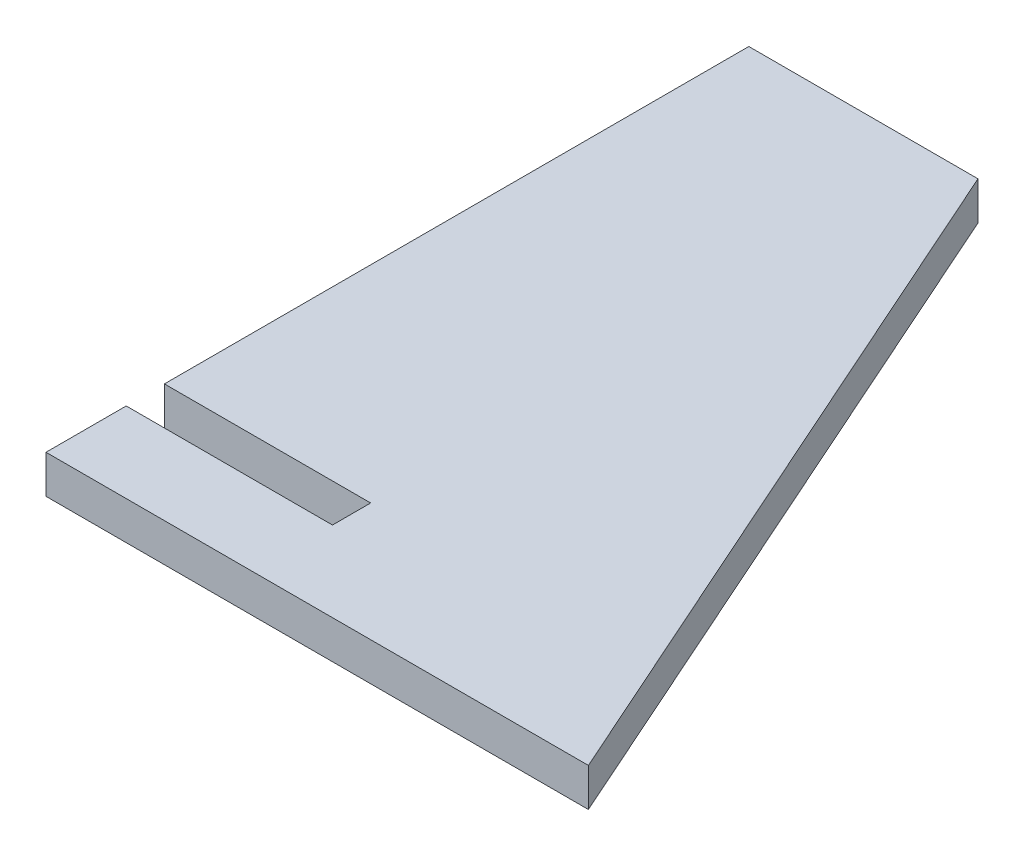
ISO-10303-21;
HEADER;
FILE_DESCRIPTION(('STEP AP214'),'2;1');
FILE_NAME('part.step','',(''),(''),'','','');
FILE_SCHEMA(('AUTOMOTIVE_DESIGN { 1 0 10303 214 1 1 1 1 }'));
ENDSEC;
DATA;
#1=APPLICATION_CONTEXT('core data for automotive mechanical design processes');
#2=APPLICATION_PROTOCOL_DEFINITION('international standard','automotive_design',2000,#1);
#3=PRODUCT_CONTEXT('',#1,'mechanical');
#4=PRODUCT('Part','Part','',(#3));
#5=PRODUCT_RELATED_PRODUCT_CATEGORY('part','',(#4));
#6=PRODUCT_DEFINITION_FORMATION('','',#4);
#7=PRODUCT_DEFINITION_CONTEXT('part definition',#1,'design');
#8=PRODUCT_DEFINITION('design','',#6,#7);
#9=PRODUCT_DEFINITION_SHAPE('','',#8);
#10=(LENGTH_UNIT() NAMED_UNIT(*) SI_UNIT(.MILLI.,.METRE.));
#11=(NAMED_UNIT(*) PLANE_ANGLE_UNIT() SI_UNIT($,.RADIAN.));
#12=(NAMED_UNIT(*) SI_UNIT($,.STERADIAN.) SOLID_ANGLE_UNIT());
#13=UNCERTAINTY_MEASURE_WITH_UNIT(LENGTH_MEASURE(1.E-05),#10,'distance_accuracy_value','');
#14=(GEOMETRIC_REPRESENTATION_CONTEXT(3) GLOBAL_UNCERTAINTY_ASSIGNED_CONTEXT((#13)) GLOBAL_UNIT_ASSIGNED_CONTEXT((#10,
#11,#12)) REPRESENTATION_CONTEXT('',''));
#15=CARTESIAN_POINT('',(0.,0.,0.));
#16=DIRECTION('',(0.,0.,1.));
#17=DIRECTION('',(1.,0.,0.));
#18=AXIS2_PLACEMENT_3D('',#15,#16,#17);
#19=CARTESIAN_POINT('',(-14.9999999999999,5.,0.));
#20=DIRECTION('',(1.,0.,0.));
#21=DIRECTION('',(0.,0.,-1.));
#22=AXIS2_PLACEMENT_3D('',#19,#20,#21);
#23=PLANE('',#22);
#24=DIRECTION('',(0.,-1.,0.));
#25=VECTOR('',#24,1.);
#26=CARTESIAN_POINT('',(-14.9999999999999,5.,-15.5000000000001));
#27=LINE('',#26,#25);
#28=CARTESIAN_POINT('',(-14.9999999999999,5.,-15.5000000000001));
#29=VERTEX_POINT('',#28);
#30=CARTESIAN_POINT('',(-14.9999999999999,0.,-15.5000000000001));
#31=VERTEX_POINT('',#30);
#32=EDGE_CURVE('E119',#29,#31,#27,.T.);
#33=ORIENTED_EDGE('',*,*,#32,.F.);
#34=DIRECTION('',(0.,0.,1.));
#35=VECTOR('',#34,1.);
#36=CARTESIAN_POINT('',(-14.9999999999999,5.,0.));
#37=LINE('',#36,#35);
#38=CARTESIAN_POINT('',(-14.9999999999999,5.,-92.));
#39=VERTEX_POINT('',#38);
#40=EDGE_CURVE('E153',#39,#29,#37,.T.);
#41=ORIENTED_EDGE('',*,*,#40,.F.);
#42=DIRECTION('',(0.,-1.,0.));
#43=VECTOR('',#42,1.);
#44=CARTESIAN_POINT('',(-14.9999999999999,5.,-92.));
#45=LINE('',#44,#43);
#46=CARTESIAN_POINT('',(-14.9999999999999,0.,-92.));
#47=VERTEX_POINT('',#46);
#48=EDGE_CURVE('E164',#39,#47,#45,.T.);
#49=ORIENTED_EDGE('',*,*,#48,.T.);
#50=DIRECTION('',(0.,0.,1.));
#51=VECTOR('',#50,1.);
#52=CARTESIAN_POINT('',(-14.9999999999999,0.,0.));
#53=LINE('',#52,#51);
#54=EDGE_CURVE('E149',#47,#31,#53,.T.);
#55=ORIENTED_EDGE('',*,*,#54,.T.);
#56=EDGE_LOOP('',(#33,#41,#49,#55));
#57=FACE_BOUND('',#56,.T.);
#58=ADVANCED_FACE('F37',(#57),#23,.F.);
#59=CARTESIAN_POINT('',(0.,5.,0.));
#60=DIRECTION('',(0.,-1.,0.));
#61=DIRECTION('',(0.,0.,-1.));
#62=AXIS2_PLACEMENT_3D('',#59,#60,#61);
#63=PLANE('',#62);
#64=DIRECTION('',(-1.,0.,0.));
#65=VECTOR('',#64,1.);
#66=CARTESIAN_POINT('',(0.,5.,-15.5000000000001));
#67=LINE('',#66,#65);
#68=CARTESIAN_POINT('',(12.0000000000001,5.,-15.5000000000001));
#69=VERTEX_POINT('',#68);
#70=EDGE_CURVE('E143',#69,#29,#67,.T.);
#71=ORIENTED_EDGE('',*,*,#70,.F.);
#72=DIRECTION('',(0.,0.,1.));
#73=VECTOR('',#72,1.);
#74=CARTESIAN_POINT('',(12.0000000000001,5.,0.));
#75=LINE('',#74,#73);
#76=CARTESIAN_POINT('',(12.0000000000001,5.,-10.5000000000001));
#77=VERTEX_POINT('',#76);
#78=EDGE_CURVE('E131',#69,#77,#75,.T.);
#79=ORIENTED_EDGE('',*,*,#78,.T.);
#80=DIRECTION('',(-1.,0.,0.));
#81=VECTOR('',#80,1.);
#82=CARTESIAN_POINT('',(0.,5.,-10.5000000000001));
#83=LINE('',#82,#81);
#84=CARTESIAN_POINT('',(-14.9999999999999,5.,-10.5000000000001));
#85=VERTEX_POINT('',#84);
#86=EDGE_CURVE('E137',#77,#85,#83,.T.);
#87=ORIENTED_EDGE('',*,*,#86,.T.);
#88=CARTESIAN_POINT('',(-14.9999999999999,5.,0.));
#89=VERTEX_POINT('',#88);
#90=EDGE_CURVE('E54',#85,#89,#37,.T.);
#91=ORIENTED_EDGE('',*,*,#90,.T.);
#92=DIRECTION('',(1.,0.,0.));
#93=VECTOR('',#92,1.);
#94=CARTESIAN_POINT('',(55.9999999999999,5.,0.));
#95=LINE('',#94,#93);
#96=CARTESIAN_POINT('',(55.9999999999999,5.,0.));
#97=VERTEX_POINT('',#96);
#98=EDGE_CURVE('E147',#89,#97,#95,.T.);
#99=ORIENTED_EDGE('',*,*,#98,.T.);
#100=DIRECTION('',(-0.407059440224397,0.,-0.913401670747433));
#101=VECTOR('',#100,1.);
#102=CARTESIAN_POINT('',(15.0000000000001,5.,-92.));
#103=LINE('',#102,#101);
#104=CARTESIAN_POINT('',(15.0000000000001,5.,-92.));
#105=VERTEX_POINT('',#104);
#106=EDGE_CURVE('E88',#97,#105,#103,.T.);
#107=ORIENTED_EDGE('',*,*,#106,.T.);
#108=DIRECTION('',(-1.,0.,0.));
#109=VECTOR('',#108,1.);
#110=CARTESIAN_POINT('',(-14.9999999999999,5.,-92.));
#111=LINE('',#110,#109);
#112=EDGE_CURVE('E151',#105,#39,#111,.T.);
#113=ORIENTED_EDGE('',*,*,#112,.T.);
#114=ORIENTED_EDGE('',*,*,#40,.T.);
#115=EDGE_LOOP('',(#71,#79,#87,#91,#99,#107,#113,#114));
#116=FACE_BOUND('',#115,.T.);
#117=ADVANCED_FACE('F176',(#116),#63,.F.);
#118=CARTESIAN_POINT('',(0.,0.,0.));
#119=DIRECTION('',(0.,-1.,0.));
#120=DIRECTION('',(0.,0.,-1.));
#121=AXIS2_PLACEMENT_3D('',#118,#119,#120);
#122=PLANE('',#121);
#123=DIRECTION('',(0.,0.,1.));
#124=VECTOR('',#123,1.);
#125=CARTESIAN_POINT('',(12.0000000000001,0.,-15.5000000000001));
#126=LINE('',#125,#124);
#127=CARTESIAN_POINT('',(12.0000000000001,0.,-15.5000000000001));
#128=VERTEX_POINT('',#127);
#129=CARTESIAN_POINT('',(12.0000000000001,0.,-10.5000000000001));
#130=VERTEX_POINT('',#129);
#131=EDGE_CURVE('E128',#128,#130,#126,.T.);
#132=ORIENTED_EDGE('',*,*,#131,.F.);
#133=DIRECTION('',(-1.,0.,0.));
#134=VECTOR('',#133,1.);
#135=CARTESIAN_POINT('',(0.,0.,-15.5000000000001));
#136=LINE('',#135,#134);
#137=EDGE_CURVE('E11',#128,#31,#136,.T.);
#138=ORIENTED_EDGE('',*,*,#137,.T.);
#139=ORIENTED_EDGE('',*,*,#54,.F.);
#140=DIRECTION('',(-1.,0.,0.));
#141=VECTOR('',#140,1.);
#142=CARTESIAN_POINT('',(-14.9999999999999,0.,-92.));
#143=LINE('',#142,#141);
#144=CARTESIAN_POINT('',(15.0000000000001,0.,-92.));
#145=VERTEX_POINT('',#144);
#146=EDGE_CURVE('E73',#145,#47,#143,.T.);
#147=ORIENTED_EDGE('',*,*,#146,.F.);
#148=DIRECTION('',(-0.407059440224397,0.,-0.913401670747433));
#149=VECTOR('',#148,1.);
#150=CARTESIAN_POINT('',(15.0000000000001,0.,-92.));
#151=LINE('',#150,#149);
#152=CARTESIAN_POINT('',(55.9999999999999,0.,0.));
#153=VERTEX_POINT('',#152);
#154=EDGE_CURVE('E159',#153,#145,#151,.T.);
#155=ORIENTED_EDGE('',*,*,#154,.F.);
#156=DIRECTION('',(1.,0.,0.));
#157=VECTOR('',#156,1.);
#158=CARTESIAN_POINT('',(55.9999999999999,0.,0.));
#159=LINE('',#158,#157);
#160=CARTESIAN_POINT('',(-14.9999999999999,0.,0.));
#161=VERTEX_POINT('',#160);
#162=EDGE_CURVE('E146',#161,#153,#159,.T.);
#163=ORIENTED_EDGE('',*,*,#162,.F.);
#164=CARTESIAN_POINT('',(-14.9999999999999,0.,-10.5000000000001));
#165=VERTEX_POINT('',#164);
#166=EDGE_CURVE('E80',#165,#161,#53,.T.);
#167=ORIENTED_EDGE('',*,*,#166,.F.);
#168=DIRECTION('',(-1.,0.,0.));
#169=VECTOR('',#168,1.);
#170=CARTESIAN_POINT('',(0.,0.,-10.5000000000001));
#171=LINE('',#170,#169);
#172=EDGE_CURVE('E46',#130,#165,#171,.T.);
#173=ORIENTED_EDGE('',*,*,#172,.F.);
#174=EDGE_LOOP('',(#132,#138,#139,#147,#155,#163,#167,#173));
#175=FACE_BOUND('',#174,.T.);
#176=ADVANCED_FACE('F134',(#175),#122,.T.);
#177=CARTESIAN_POINT('',(55.9999999999999,5.,0.));
#178=DIRECTION('',(0.,0.,-1.));
#179=DIRECTION('',(-1.,0.,0.));
#180=AXIS2_PLACEMENT_3D('',#177,#178,#179);
#181=PLANE('',#180);
#182=ORIENTED_EDGE('',*,*,#162,.T.);
#183=DIRECTION('',(0.,-1.,0.));
#184=VECTOR('',#183,1.);
#185=CARTESIAN_POINT('',(55.9999999999999,5.,0.));
#186=LINE('',#185,#184);
#187=EDGE_CURVE('E168',#97,#153,#186,.T.);
#188=ORIENTED_EDGE('',*,*,#187,.F.);
#189=ORIENTED_EDGE('',*,*,#98,.F.);
#190=DIRECTION('',(0.,-1.,0.));
#191=VECTOR('',#190,1.);
#192=CARTESIAN_POINT('',(-14.9999999999999,5.,0.));
#193=LINE('',#192,#191);
#194=EDGE_CURVE('E156',#89,#161,#193,.T.);
#195=ORIENTED_EDGE('',*,*,#194,.T.);
#196=EDGE_LOOP('',(#182,#188,#189,#195));
#197=FACE_BOUND('',#196,.T.);
#198=ADVANCED_FACE('F39',(#197),#181,.F.);
#199=CARTESIAN_POINT('',(15.0000000000001,5.,-92.));
#200=DIRECTION('',(-0.913401670747433,0.,0.407059440224397));
#201=DIRECTION('',(0.407059440224397,0.,0.913401670747433));
#202=AXIS2_PLACEMENT_3D('',#199,#200,#201);
#203=PLANE('',#202);
#204=ORIENTED_EDGE('',*,*,#154,.T.);
#205=DIRECTION('',(0.,-1.,0.));
#206=VECTOR('',#205,1.);
#207=CARTESIAN_POINT('',(15.0000000000001,5.,-92.));
#208=LINE('',#207,#206);
#209=EDGE_CURVE('E166',#105,#145,#208,.T.);
#210=ORIENTED_EDGE('',*,*,#209,.F.);
#211=ORIENTED_EDGE('',*,*,#106,.F.);
#212=ORIENTED_EDGE('',*,*,#187,.T.);
#213=EDGE_LOOP('',(#204,#210,#211,#212));
#214=FACE_BOUND('',#213,.T.);
#215=ADVANCED_FACE('F178',(#214),#203,.F.);
#216=CARTESIAN_POINT('',(-14.9999999999999,5.,-92.));
#217=DIRECTION('',(0.,0.,1.));
#218=DIRECTION('',(1.,0.,0.));
#219=AXIS2_PLACEMENT_3D('',#216,#217,#218);
#220=PLANE('',#219);
#221=ORIENTED_EDGE('',*,*,#146,.T.);
#222=ORIENTED_EDGE('',*,*,#48,.F.);
#223=ORIENTED_EDGE('',*,*,#112,.F.);
#224=ORIENTED_EDGE('',*,*,#209,.T.);
#225=EDGE_LOOP('',(#221,#222,#223,#224));
#226=FACE_BOUND('',#225,.T.);
#227=ADVANCED_FACE('F179',(#226),#220,.F.);
#228=ORIENTED_EDGE('',*,*,#90,.F.);
#229=DIRECTION('',(0.,-1.,0.));
#230=VECTOR('',#229,1.);
#231=CARTESIAN_POINT('',(-14.9999999999999,5.,-10.5000000000001));
#232=LINE('',#231,#230);
#233=EDGE_CURVE('E135',#85,#165,#232,.T.);
#234=ORIENTED_EDGE('',*,*,#233,.T.);
#235=ORIENTED_EDGE('',*,*,#166,.T.);
#236=ORIENTED_EDGE('',*,*,#194,.F.);
#237=EDGE_LOOP('',(#228,#234,#235,#236));
#238=FACE_BOUND('',#237,.T.);
#239=ADVANCED_FACE('F171',(#238),#23,.F.);
#240=CARTESIAN_POINT('',(12.0000000000001,0.,-15.5000000000001));
#241=DIRECTION('',(1.,0.,0.));
#242=DIRECTION('',(0.,0.,-1.));
#243=AXIS2_PLACEMENT_3D('',#240,#241,#242);
#244=PLANE('',#243);
#245=DIRECTION('',(0.,1.,0.));
#246=VECTOR('',#245,1.);
#247=CARTESIAN_POINT('',(12.0000000000001,0.,-15.5000000000001));
#248=LINE('',#247,#246);
#249=EDGE_CURVE('E116',#128,#69,#248,.T.);
#250=ORIENTED_EDGE('',*,*,#249,.F.);
#251=ORIENTED_EDGE('',*,*,#131,.T.);
#252=DIRECTION('',(0.,1.,0.));
#253=VECTOR('',#252,1.);
#254=CARTESIAN_POINT('',(12.0000000000001,0.,-10.5000000000001));
#255=LINE('',#254,#253);
#256=EDGE_CURVE('E132',#130,#77,#255,.T.);
#257=ORIENTED_EDGE('',*,*,#256,.T.);
#258=ORIENTED_EDGE('',*,*,#78,.F.);
#259=EDGE_LOOP('',(#250,#251,#257,#258));
#260=FACE_BOUND('',#259,.T.);
#261=ADVANCED_FACE('F126',(#260),#244,.F.);
#262=CARTESIAN_POINT('',(-11.9999999999999,-3.00000000000002,-15.5000000000001));
#263=DIRECTION('',(0.,0.,1.));
#264=DIRECTION('',(1.,0.,0.));
#265=AXIS2_PLACEMENT_3D('',#262,#263,#264);
#266=PLANE('',#265);
#267=ORIENTED_EDGE('',*,*,#70,.T.);
#268=ORIENTED_EDGE('',*,*,#32,.T.);
#269=ORIENTED_EDGE('',*,*,#137,.F.);
#270=ORIENTED_EDGE('',*,*,#249,.T.);
#271=EDGE_LOOP('',(#267,#268,#269,#270));
#272=FACE_BOUND('',#271,.T.);
#273=ADVANCED_FACE('F115',(#272),#266,.T.);
#274=CARTESIAN_POINT('',(-11.9999999999999,-3.00000000000002,-10.5000000000001));
#275=DIRECTION('',(0.,0.,1.));
#276=DIRECTION('',(1.,0.,0.));
#277=AXIS2_PLACEMENT_3D('',#274,#275,#276);
#278=PLANE('',#277);
#279=ORIENTED_EDGE('',*,*,#256,.F.);
#280=ORIENTED_EDGE('',*,*,#172,.T.);
#281=ORIENTED_EDGE('',*,*,#233,.F.);
#282=ORIENTED_EDGE('',*,*,#86,.F.);
#283=EDGE_LOOP('',(#279,#280,#281,#282));
#284=FACE_BOUND('',#283,.T.);
#285=ADVANCED_FACE('F170',(#284),#278,.F.);
#286=CLOSED_SHELL('',(#58,#117,#176,#198,#215,#227,#239,#261,#273,#285));
#287=MANIFOLD_SOLID_BREP('B2',#286);
#288=ADVANCED_BREP_SHAPE_REPRESENTATION('',(#18,#287),#14);
#289=SHAPE_DEFINITION_REPRESENTATION(#9,#288);
ENDSEC;
END-ISO-10303-21;
